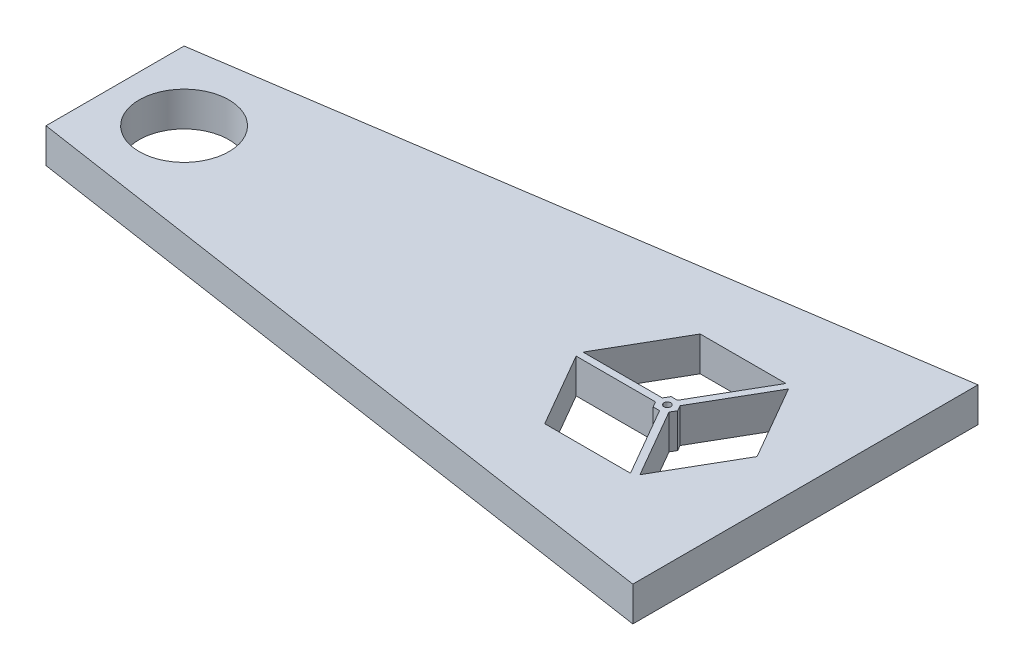
ISO-10303-21;
HEADER;
FILE_DESCRIPTION(('STEP AP214'),'2;1');
FILE_NAME('part.step','',(''),(''),'','','');
FILE_SCHEMA(('AUTOMOTIVE_DESIGN { 1 0 10303 214 1 1 1 1 }'));
ENDSEC;
DATA;
#1=APPLICATION_CONTEXT('core data for automotive mechanical design processes');
#2=APPLICATION_PROTOCOL_DEFINITION('international standard','automotive_design',2000,#1);
#3=PRODUCT_CONTEXT('',#1,'mechanical');
#4=PRODUCT('Part','Part','',(#3));
#5=PRODUCT_RELATED_PRODUCT_CATEGORY('part','',(#4));
#6=PRODUCT_DEFINITION_FORMATION('','',#4);
#7=PRODUCT_DEFINITION_CONTEXT('part definition',#1,'design');
#8=PRODUCT_DEFINITION('design','',#6,#7);
#9=PRODUCT_DEFINITION_SHAPE('','',#8);
#10=(LENGTH_UNIT() NAMED_UNIT(*) SI_UNIT(.MILLI.,.METRE.));
#11=(NAMED_UNIT(*) PLANE_ANGLE_UNIT() SI_UNIT($,.RADIAN.));
#12=(NAMED_UNIT(*) SI_UNIT($,.STERADIAN.) SOLID_ANGLE_UNIT());
#13=UNCERTAINTY_MEASURE_WITH_UNIT(LENGTH_MEASURE(1.E-05),#10,'distance_accuracy_value','');
#14=(GEOMETRIC_REPRESENTATION_CONTEXT(3) GLOBAL_UNCERTAINTY_ASSIGNED_CONTEXT((#13)) GLOBAL_UNIT_ASSIGNED_CONTEXT((#10,
#11,#12)) REPRESENTATION_CONTEXT('',''));
#15=CARTESIAN_POINT('',(0.,0.,0.));
#16=DIRECTION('',(0.,0.,1.));
#17=DIRECTION('',(1.,0.,0.));
#18=AXIS2_PLACEMENT_3D('',#15,#16,#17);
#19=CARTESIAN_POINT('',(23.5,-5.,-11.2583302491977));
#20=DIRECTION('',(-0.866025403784439,0.,-0.5));
#21=DIRECTION('',(-0.5,0.,0.866025403784439));
#22=AXIS2_PLACEMENT_3D('',#19,#20,#21);
#23=PLANE('',#22);
#24=DIRECTION('',(0.,1.,0.));
#25=VECTOR('',#24,1.);
#26=CARTESIAN_POINT('',(17.2886751345948,-5.,-0.499999999999999));
#27=LINE('',#26,#25);
#28=CARTESIAN_POINT('',(17.2886751345948,0.,-0.499999999999999));
#29=VERTEX_POINT('',#28);
#30=CARTESIAN_POINT('',(17.2886751345948,5.,-0.499999999999999));
#31=VERTEX_POINT('',#30);
#32=EDGE_CURVE('E424',#29,#31,#27,.T.);
#33=ORIENTED_EDGE('',*,*,#32,.F.);
#34=DIRECTION('',(0.5,0.,-0.866025403784439));
#35=VECTOR('',#34,1.);
#36=CARTESIAN_POINT('',(12.75,0.,7.36121593216772));
#37=LINE('',#36,#35);
#38=CARTESIAN_POINT('',(23.5,0.,-11.2583302491977));
#39=VERTEX_POINT('',#38);
#40=EDGE_CURVE('E408',#29,#39,#37,.T.);
#41=ORIENTED_EDGE('',*,*,#40,.T.);
#42=DIRECTION('',(0.,1.,0.));
#43=VECTOR('',#42,1.);
#44=CARTESIAN_POINT('',(23.5,-5.,-11.2583302491977));
#45=LINE('',#44,#43);
#46=CARTESIAN_POINT('',(23.5,5.,-11.2583302491977));
#47=VERTEX_POINT('',#46);
#48=EDGE_CURVE('E375',#39,#47,#45,.T.);
#49=ORIENTED_EDGE('',*,*,#48,.T.);
#50=DIRECTION('',(-0.5,0.,0.866025403784439));
#51=VECTOR('',#50,1.);
#52=CARTESIAN_POINT('',(23.5,5.,-11.2583302491977));
#53=LINE('',#52,#51);
#54=EDGE_CURVE('E372',#47,#31,#53,.T.);
#55=ORIENTED_EDGE('',*,*,#54,.T.);
#56=EDGE_LOOP('',(#33,#41,#49,#55));
#57=FACE_BOUND('',#56,.T.);
#58=ADVANCED_FACE('F118',(#57),#23,.F.);
#59=CARTESIAN_POINT('',(36.5,-5.,-11.2583302491977));
#60=DIRECTION('',(0.,0.,-1.));
#61=DIRECTION('',(-1.,0.,0.));
#62=AXIS2_PLACEMENT_3D('',#59,#60,#61);
#63=PLANE('',#62);
#64=DIRECTION('',(0.,-1.,0.));
#65=VECTOR('',#64,1.);
#66=CARTESIAN_POINT('',(35.9226497308103,-5.,-11.2583302491977));
#67=LINE('',#66,#65);
#68=CARTESIAN_POINT('',(35.9226497308104,5.,-11.2583302491977));
#69=VERTEX_POINT('',#68);
#70=CARTESIAN_POINT('',(35.9226497308104,0.,-11.2583302491977));
#71=VERTEX_POINT('',#70);
#72=EDGE_CURVE('E421',#69,#71,#67,.T.);
#73=ORIENTED_EDGE('',*,*,#72,.F.);
#74=DIRECTION('',(-1.,0.,0.));
#75=VECTOR('',#74,1.);
#76=CARTESIAN_POINT('',(36.5,5.,-11.2583302491977));
#77=LINE('',#76,#75);
#78=EDGE_CURVE('E370',#69,#47,#77,.T.);
#79=ORIENTED_EDGE('',*,*,#78,.T.);
#80=ORIENTED_EDGE('',*,*,#48,.F.);
#81=DIRECTION('',(1.,0.,0.));
#82=VECTOR('',#81,1.);
#83=CARTESIAN_POINT('',(0.,0.,-11.2583302491977));
#84=LINE('',#83,#82);
#85=EDGE_CURVE('E405',#39,#71,#84,.T.);
#86=ORIENTED_EDGE('',*,*,#85,.T.);
#87=EDGE_LOOP('',(#73,#79,#80,#86));
#88=FACE_BOUND('',#87,.T.);
#89=ADVANCED_FACE('F453',(#88),#63,.F.);
#90=CARTESIAN_POINT('',(36.5,-5.,11.2583302491977));
#91=DIRECTION('',(0.866025403784439,0.,0.5));
#92=DIRECTION('',(0.5,0.,-0.866025403784439));
#93=AXIS2_PLACEMENT_3D('',#90,#91,#92);
#94=PLANE('',#93);
#95=DIRECTION('',(0.,-1.,0.));
#96=VECTOR('',#95,1.);
#97=CARTESIAN_POINT('',(36.7886751345948,-5.,10.7583302491977));
#98=LINE('',#97,#96);
#99=CARTESIAN_POINT('',(36.7886751345948,5.,10.7583302491977));
#100=VERTEX_POINT('',#99);
#101=CARTESIAN_POINT('',(36.7886751345948,0.,10.7583302491977));
#102=VERTEX_POINT('',#101);
#103=EDGE_CURVE('E415',#100,#102,#98,.T.);
#104=ORIENTED_EDGE('',*,*,#103,.F.);
#105=DIRECTION('',(0.5,0.,-0.866025403784439));
#106=VECTOR('',#105,1.);
#107=CARTESIAN_POINT('',(36.5,5.,11.2583302491977));
#108=LINE('',#107,#106);
#109=CARTESIAN_POINT('',(43.,5.,0.));
#110=VERTEX_POINT('',#109);
#111=EDGE_CURVE('E365',#100,#110,#108,.T.);
#112=ORIENTED_EDGE('',*,*,#111,.T.);
#113=DIRECTION('',(0.,1.,0.));
#114=VECTOR('',#113,1.);
#115=CARTESIAN_POINT('',(43.,-5.,0.));
#116=LINE('',#115,#114);
#117=CARTESIAN_POINT('',(43.,0.,0.));
#118=VERTEX_POINT('',#117);
#119=EDGE_CURVE('E379',#118,#110,#116,.T.);
#120=ORIENTED_EDGE('',*,*,#119,.F.);
#121=DIRECTION('',(-0.5,0.,0.866025403784439));
#122=VECTOR('',#121,1.);
#123=CARTESIAN_POINT('',(32.25,0.,18.6195461813654));
#124=LINE('',#123,#122);
#125=EDGE_CURVE('E400',#118,#102,#124,.T.);
#126=ORIENTED_EDGE('',*,*,#125,.T.);
#127=EDGE_LOOP('',(#104,#112,#120,#126));
#128=FACE_BOUND('',#127,.T.);
#129=ADVANCED_FACE('F478',(#128),#94,.F.);
#130=CARTESIAN_POINT('',(-50.,5.,-25.));
#131=DIRECTION('',(1.,0.,0.));
#132=DIRECTION('',(0.,0.,-1.));
#133=AXIS2_PLACEMENT_3D('',#130,#131,#132);
#134=PLANE('',#133);
#135=DIRECTION('',(0.,0.,1.));
#136=VECTOR('',#135,1.);
#137=CARTESIAN_POINT('',(-50.,5.,-25.));
#138=LINE('',#137,#136);
#139=CARTESIAN_POINT('',(-50.,5.,-10.));
#140=VERTEX_POINT('',#139);
#141=CARTESIAN_POINT('',(-50.,5.,10.));
#142=VERTEX_POINT('',#141);
#143=EDGE_CURVE('E384',#140,#142,#138,.T.);
#144=ORIENTED_EDGE('',*,*,#143,.F.);
#145=DIRECTION('',(0.,1.,0.));
#146=VECTOR('',#145,1.);
#147=CARTESIAN_POINT('',(-50.,0.,-10.));
#148=LINE('',#147,#146);
#149=CARTESIAN_POINT('',(-50.,0.,-10.));
#150=VERTEX_POINT('',#149);
#151=EDGE_CURVE('E349',#150,#140,#148,.T.);
#152=ORIENTED_EDGE('',*,*,#151,.F.);
#153=DIRECTION('',(0.,0.,1.));
#154=VECTOR('',#153,1.);
#155=CARTESIAN_POINT('',(-50.,0.,-25.));
#156=LINE('',#155,#154);
#157=CARTESIAN_POINT('',(-50.,0.,10.));
#158=VERTEX_POINT('',#157);
#159=EDGE_CURVE('E378',#150,#158,#156,.T.);
#160=ORIENTED_EDGE('',*,*,#159,.T.);
#161=DIRECTION('',(0.,1.,0.));
#162=VECTOR('',#161,1.);
#163=CARTESIAN_POINT('',(-50.,0.,10.));
#164=LINE('',#163,#162);
#165=EDGE_CURVE('E355',#158,#142,#164,.T.);
#166=ORIENTED_EDGE('',*,*,#165,.T.);
#167=EDGE_LOOP('',(#144,#152,#160,#166));
#168=FACE_BOUND('',#167,.T.);
#169=ADVANCED_FACE('F120',(#168),#134,.F.);
#170=CARTESIAN_POINT('',(0.,5.,0.));
#171=DIRECTION('',(0.,-1.,0.));
#172=DIRECTION('',(0.,0.,-1.));
#173=AXIS2_PLACEMENT_3D('',#170,#171,#172);
#174=PLANE('',#173);
#175=CARTESIAN_POINT('',(30.,5.,0.));
#176=DIRECTION('',(0.,1.,0.));
#177=DIRECTION('',(0.,0.,1.));
#178=AXIS2_PLACEMENT_3D('',#175,#176,#177);
#179=CIRCLE('',#178,0.499999999999999);
#180=CARTESIAN_POINT('',(30.,5.,0.499999999999999));
#181=VERTEX_POINT('',#180);
#182=EDGE_CURVE('E583',#181,#181,#179,.T.);
#183=ORIENTED_EDGE('',*,*,#182,.F.);
#184=EDGE_LOOP('',(#183));
#185=FACE_BOUND('',#184,.T.);
#186=CARTESIAN_POINT('',(-40.,5.,0.));
#187=DIRECTION('',(0.,1.,0.));
#188=DIRECTION('',(0.,0.,1.));
#189=AXIS2_PLACEMENT_3D('',#186,#187,#188);
#190=CIRCLE('',#189,6.5);
#191=CARTESIAN_POINT('',(-40.,5.,6.5));
#192=VERTEX_POINT('',#191);
#193=EDGE_CURVE('E585',#192,#192,#190,.T.);
#194=ORIENTED_EDGE('',*,*,#193,.F.);
#195=EDGE_LOOP('',(#194));
#196=FACE_BOUND('',#195,.T.);
#197=DIRECTION('',(1.,0.,0.));
#198=VECTOR('',#197,1.);
#199=CARTESIAN_POINT('',(29.25,5.,1.29903810567666));
#200=LINE('',#199,#198);
#201=CARTESIAN_POINT('',(29.25,5.,1.29903810567666));
#202=VERTEX_POINT('',#201);
#203=CARTESIAN_POINT('',(30.1726497308104,5.,1.29903810567666));
#204=VERTEX_POINT('',#203);
#205=EDGE_CURVE('E277',#202,#204,#200,.T.);
#206=ORIENTED_EDGE('',*,*,#205,.T.);
#207=DIRECTION('',(0.499999999999999,0.,0.866025403784439));
#208=VECTOR('',#207,1.);
#209=CARTESIAN_POINT('',(29.5669872981078,5.,0.25));
#210=LINE('',#209,#208);
#211=CARTESIAN_POINT('',(35.9226497308103,5.,11.2583302491977));
#212=VERTEX_POINT('',#211);
#213=EDGE_CURVE('E319',#204,#212,#210,.T.);
#214=ORIENTED_EDGE('',*,*,#213,.T.);
#215=DIRECTION('',(1.,0.,0.));
#216=VECTOR('',#215,1.);
#217=CARTESIAN_POINT('',(23.5,5.,11.2583302491977));
#218=LINE('',#217,#216);
#219=CARTESIAN_POINT('',(23.5,5.,11.2583302491977));
#220=VERTEX_POINT('',#219);
#221=EDGE_CURVE('E362',#220,#212,#218,.T.);
#222=ORIENTED_EDGE('',*,*,#221,.F.);
#223=DIRECTION('',(0.5,0.,0.866025403784438));
#224=VECTOR('',#223,1.);
#225=CARTESIAN_POINT('',(17.,5.,0.));
#226=LINE('',#225,#224);
#227=CARTESIAN_POINT('',(17.2886751345948,5.,0.500000000000001));
#228=VERTEX_POINT('',#227);
#229=EDGE_CURVE('E360',#228,#220,#226,.T.);
#230=ORIENTED_EDGE('',*,*,#229,.F.);
#231=DIRECTION('',(1.,0.,0.));
#232=VECTOR('',#231,1.);
#233=CARTESIAN_POINT('',(17.,5.,0.500000000000001));
#234=LINE('',#233,#232);
#235=CARTESIAN_POINT('',(28.7886751345948,5.,0.5));
#236=VERTEX_POINT('',#235);
#237=EDGE_CURVE('E335',#228,#236,#234,.T.);
#238=ORIENTED_EDGE('',*,*,#237,.T.);
#239=DIRECTION('',(0.500000000000002,0.,0.866025403784437));
#240=VECTOR('',#239,1.);
#241=CARTESIAN_POINT('',(28.5,5.,0.));
#242=LINE('',#241,#240);
#243=EDGE_CURVE('E313',#236,#202,#242,.T.);
#244=ORIENTED_EDGE('',*,*,#243,.T.);
#245=EDGE_LOOP('',(#206,#214,#222,#230,#238,#244));
#246=FACE_BOUND('',#245,.T.);
#247=DIRECTION('',(-0.499999999999998,0.,0.866025403784439));
#248=VECTOR('',#247,1.);
#249=CARTESIAN_POINT('',(29.25,5.,-1.29903810567666));
#250=LINE('',#249,#248);
#251=CARTESIAN_POINT('',(29.25,5.,-1.29903810567666));
#252=VERTEX_POINT('',#251);
#253=CARTESIAN_POINT('',(28.7886751345948,5.,-0.5));
#254=VERTEX_POINT('',#253);
#255=EDGE_CURVE('E310',#252,#254,#250,.T.);
#256=ORIENTED_EDGE('',*,*,#255,.T.);
#257=DIRECTION('',(1.,0.,0.));
#258=VECTOR('',#257,1.);
#259=CARTESIAN_POINT('',(17.,5.,-0.499999999999999));
#260=LINE('',#259,#258);
#261=EDGE_CURVE('E133',#31,#254,#260,.T.);
#262=ORIENTED_EDGE('',*,*,#261,.F.);
#263=ORIENTED_EDGE('',*,*,#54,.F.);
#264=ORIENTED_EDGE('',*,*,#78,.F.);
#265=DIRECTION('',(0.499999999999999,0.,-0.866025403784439));
#266=VECTOR('',#265,1.);
#267=CARTESIAN_POINT('',(29.5669872981078,5.,-0.25));
#268=LINE('',#267,#266);
#269=CARTESIAN_POINT('',(30.1726497308104,5.,-1.29903810567666));
#270=VERTEX_POINT('',#269);
#271=EDGE_CURVE('E324',#270,#69,#268,.T.);
#272=ORIENTED_EDGE('',*,*,#271,.F.);
#273=DIRECTION('',(-1.,0.,0.));
#274=VECTOR('',#273,1.);
#275=CARTESIAN_POINT('',(30.75,5.,-1.29903810567666));
#276=LINE('',#275,#274);
#277=EDGE_CURVE('E308',#270,#252,#276,.T.);
#278=ORIENTED_EDGE('',*,*,#277,.T.);
#279=EDGE_LOOP('',(#256,#262,#263,#264,#272,#278));
#280=FACE_BOUND('',#279,.T.);
#281=DIRECTION('',(0.499999999999999,0.,0.866025403784439));
#282=VECTOR('',#281,1.);
#283=CARTESIAN_POINT('',(30.4330127018922,5.,-0.25));
#284=LINE('',#283,#282);
#285=CARTESIAN_POINT('',(31.0386751345948,5.,0.799038105676666));
#286=VERTEX_POINT('',#285);
#287=EDGE_CURVE('E342',#286,#100,#284,.T.);
#288=ORIENTED_EDGE('',*,*,#287,.F.);
#289=DIRECTION('',(0.499999999999997,0.,-0.86602540378444));
#290=VECTOR('',#289,1.);
#291=CARTESIAN_POINT('',(30.75,5.,1.29903810567666));
#292=LINE('',#291,#290);
#293=CARTESIAN_POINT('',(31.5,5.,0.));
#294=VERTEX_POINT('',#293);
#295=EDGE_CURVE('E304',#286,#294,#292,.T.);
#296=ORIENTED_EDGE('',*,*,#295,.T.);
#297=DIRECTION('',(-0.500000000000004,0.,-0.866025403784436));
#298=VECTOR('',#297,1.);
#299=CARTESIAN_POINT('',(31.5,5.,0.));
#300=LINE('',#299,#298);
#301=CARTESIAN_POINT('',(31.0386751345948,5.,-0.799038105676671));
#302=VERTEX_POINT('',#301);
#303=EDGE_CURVE('E284',#294,#302,#300,.T.);
#304=ORIENTED_EDGE('',*,*,#303,.T.);
#305=DIRECTION('',(0.499999999999999,0.,-0.866025403784439));
#306=VECTOR('',#305,1.);
#307=CARTESIAN_POINT('',(30.4330127018922,5.,0.25));
#308=LINE('',#307,#306);
#309=CARTESIAN_POINT('',(36.7886751345948,5.,-10.7583302491977));
#310=VERTEX_POINT('',#309);
#311=EDGE_CURVE('E327',#302,#310,#308,.T.);
#312=ORIENTED_EDGE('',*,*,#311,.T.);
#313=DIRECTION('',(-0.5,0.,-0.866025403784438));
#314=VECTOR('',#313,1.);
#315=CARTESIAN_POINT('',(43.,5.,0.));
#316=LINE('',#315,#314);
#317=EDGE_CURVE('E367',#110,#310,#316,.T.);
#318=ORIENTED_EDGE('',*,*,#317,.F.);
#319=ORIENTED_EDGE('',*,*,#111,.F.);
#320=EDGE_LOOP('',(#288,#296,#304,#312,#318,#319));
#321=FACE_BOUND('',#320,.T.);
#322=DIRECTION('',(0.,0.,-1.));
#323=VECTOR('',#322,1.);
#324=CARTESIAN_POINT('',(50.,5.,-25.));
#325=LINE('',#324,#323);
#326=CARTESIAN_POINT('',(50.,5.,25.));
#327=VERTEX_POINT('',#326);
#328=CARTESIAN_POINT('',(50.,5.,-25.));
#329=VERTEX_POINT('',#328);
#330=EDGE_CURVE('E386',#327,#329,#325,.T.);
#331=ORIENTED_EDGE('',*,*,#330,.T.);
#332=DIRECTION('',(0.988936352868298,0.,-0.148340452930245));
#333=VECTOR('',#332,1.);
#334=CARTESIAN_POINT('',(-2.56723716381418,5.,-17.1149144254279));
#335=LINE('',#334,#333);
#336=EDGE_CURVE('E326',#140,#329,#335,.T.);
#337=ORIENTED_EDGE('',*,*,#336,.F.);
#338=ORIENTED_EDGE('',*,*,#143,.T.);
#339=DIRECTION('',(0.988936352868298,0.,0.148340452930245));
#340=VECTOR('',#339,1.);
#341=CARTESIAN_POINT('',(-2.56723716381418,5.,17.1149144254279));
#342=LINE('',#341,#340);
#343=EDGE_CURVE('E352',#142,#327,#342,.T.);
#344=ORIENTED_EDGE('',*,*,#343,.T.);
#345=EDGE_LOOP('',(#331,#337,#338,#344));
#346=FACE_BOUND('',#345,.T.);
#347=ADVANCED_FACE('F447',(#185,#196,#246,#280,#321,#346),#174,.F.);
#348=CARTESIAN_POINT('',(0.,0.,0.));
#349=DIRECTION('',(0.,-1.,0.));
#350=DIRECTION('',(0.,0.,-1.));
#351=AXIS2_PLACEMENT_3D('',#348,#349,#350);
#352=PLANE('',#351);
#353=CARTESIAN_POINT('',(30.,0.,0.));
#354=DIRECTION('',(0.,1.,0.));
#355=DIRECTION('',(0.,0.,1.));
#356=AXIS2_PLACEMENT_3D('',#353,#354,#355);
#357=CIRCLE('',#356,0.499999999999999);
#358=CARTESIAN_POINT('',(30.,0.,0.499999999999999));
#359=VERTEX_POINT('',#358);
#360=EDGE_CURVE('E580',#359,#359,#357,.T.);
#361=ORIENTED_EDGE('',*,*,#360,.T.);
#362=EDGE_LOOP('',(#361));
#363=FACE_BOUND('',#362,.T.);
#364=CARTESIAN_POINT('',(-40.,0.,0.));
#365=DIRECTION('',(0.,1.,0.));
#366=DIRECTION('',(0.,0.,1.));
#367=AXIS2_PLACEMENT_3D('',#364,#365,#366);
#368=CIRCLE('',#367,6.5);
#369=CARTESIAN_POINT('',(-40.,0.,6.5));
#370=VERTEX_POINT('',#369);
#371=EDGE_CURVE('E306',#370,#370,#368,.T.);
#372=ORIENTED_EDGE('',*,*,#371,.T.);
#373=EDGE_LOOP('',(#372));
#374=FACE_BOUND('',#373,.T.);
#375=DIRECTION('',(0.499999999999999,0.,0.866025403784439));
#376=VECTOR('',#375,1.);
#377=CARTESIAN_POINT('',(29.5669872981078,0.,0.25));
#378=LINE('',#377,#376);
#379=CARTESIAN_POINT('',(30.1726497308104,0.,1.29903810567666));
#380=VERTEX_POINT('',#379);
#381=CARTESIAN_POINT('',(35.9226497308103,0.,11.2583302491977));
#382=VERTEX_POINT('',#381);
#383=EDGE_CURVE('E340',#380,#382,#378,.T.);
#384=ORIENTED_EDGE('',*,*,#383,.F.);
#385=DIRECTION('',(1.,0.,0.));
#386=VECTOR('',#385,1.);
#387=CARTESIAN_POINT('',(29.25,0.,1.29903810567666));
#388=LINE('',#387,#386);
#389=CARTESIAN_POINT('',(29.25,0.,1.29903810567666));
#390=VERTEX_POINT('',#389);
#391=EDGE_CURVE('E286',#390,#380,#388,.T.);
#392=ORIENTED_EDGE('',*,*,#391,.F.);
#393=DIRECTION('',(0.500000000000002,0.,0.866025403784437));
#394=VECTOR('',#393,1.);
#395=CARTESIAN_POINT('',(28.5,0.,0.));
#396=LINE('',#395,#394);
#397=CARTESIAN_POINT('',(28.7886751345948,0.,0.5));
#398=VERTEX_POINT('',#397);
#399=EDGE_CURVE('E301',#398,#390,#396,.T.);
#400=ORIENTED_EDGE('',*,*,#399,.F.);
#401=DIRECTION('',(1.,0.,0.));
#402=VECTOR('',#401,1.);
#403=CARTESIAN_POINT('',(17.,0.,0.500000000000001));
#404=LINE('',#403,#402);
#405=CARTESIAN_POINT('',(17.2886751345948,0.,0.500000000000004));
#406=VERTEX_POINT('',#405);
#407=EDGE_CURVE('E331',#406,#398,#404,.T.);
#408=ORIENTED_EDGE('',*,*,#407,.F.);
#409=DIRECTION('',(-0.5,0.,-0.866025403784439));
#410=VECTOR('',#409,1.);
#411=CARTESIAN_POINT('',(12.75,0.,-7.36121593216773));
#412=LINE('',#411,#410);
#413=CARTESIAN_POINT('',(23.5,0.,11.2583302491977));
#414=VERTEX_POINT('',#413);
#415=EDGE_CURVE('E410',#414,#406,#412,.T.);
#416=ORIENTED_EDGE('',*,*,#415,.F.);
#417=DIRECTION('',(-1.,0.,0.));
#418=VECTOR('',#417,1.);
#419=CARTESIAN_POINT('',(0.,0.,11.2583302491977));
#420=LINE('',#419,#418);
#421=EDGE_CURVE('E398',#382,#414,#420,.T.);
#422=ORIENTED_EDGE('',*,*,#421,.F.);
#423=EDGE_LOOP('',(#384,#392,#400,#408,#416,#422));
#424=FACE_BOUND('',#423,.T.);
#425=DIRECTION('',(1.,0.,0.));
#426=VECTOR('',#425,1.);
#427=CARTESIAN_POINT('',(17.,0.,-0.499999999999999));
#428=LINE('',#427,#426);
#429=CARTESIAN_POINT('',(28.7886751345948,0.,-0.5));
#430=VERTEX_POINT('',#429);
#431=EDGE_CURVE('E329',#29,#430,#428,.T.);
#432=ORIENTED_EDGE('',*,*,#431,.T.);
#433=DIRECTION('',(-0.499999999999998,0.,0.866025403784439));
#434=VECTOR('',#433,1.);
#435=CARTESIAN_POINT('',(29.25,0.,-1.29903810567666));
#436=LINE('',#435,#434);
#437=CARTESIAN_POINT('',(29.25,0.,-1.29903810567666));
#438=VERTEX_POINT('',#437);
#439=EDGE_CURVE('E295',#438,#430,#436,.T.);
#440=ORIENTED_EDGE('',*,*,#439,.F.);
#441=DIRECTION('',(-1.,0.,0.));
#442=VECTOR('',#441,1.);
#443=CARTESIAN_POINT('',(30.75,0.,-1.29903810567666));
#444=LINE('',#443,#442);
#445=CARTESIAN_POINT('',(30.1726497308104,0.,-1.29903810567666));
#446=VERTEX_POINT('',#445);
#447=EDGE_CURVE('E293',#446,#438,#444,.T.);
#448=ORIENTED_EDGE('',*,*,#447,.F.);
#449=DIRECTION('',(0.499999999999999,0.,-0.866025403784439));
#450=VECTOR('',#449,1.);
#451=CARTESIAN_POINT('',(29.5669872981078,0.,-0.25));
#452=LINE('',#451,#450);
#453=EDGE_CURVE('E323',#446,#71,#452,.T.);
#454=ORIENTED_EDGE('',*,*,#453,.T.);
#455=ORIENTED_EDGE('',*,*,#85,.F.);
#456=ORIENTED_EDGE('',*,*,#40,.F.);
#457=EDGE_LOOP('',(#432,#440,#448,#454,#455,#456));
#458=FACE_BOUND('',#457,.T.);
#459=DIRECTION('',(0.499999999999997,0.,-0.86602540378444));
#460=VECTOR('',#459,1.);
#461=CARTESIAN_POINT('',(30.75,0.,1.29903810567666));
#462=LINE('',#461,#460);
#463=CARTESIAN_POINT('',(31.0386751345948,0.,0.799038105676666));
#464=VERTEX_POINT('',#463);
#465=CARTESIAN_POINT('',(31.5,0.,0.));
#466=VERTEX_POINT('',#465);
#467=EDGE_CURVE('E266',#464,#466,#462,.T.);
#468=ORIENTED_EDGE('',*,*,#467,.F.);
#469=DIRECTION('',(0.499999999999999,0.,0.866025403784439));
#470=VECTOR('',#469,1.);
#471=CARTESIAN_POINT('',(30.4330127018922,0.,-0.25));
#472=LINE('',#471,#470);
#473=EDGE_CURVE('E338',#464,#102,#472,.T.);
#474=ORIENTED_EDGE('',*,*,#473,.T.);
#475=ORIENTED_EDGE('',*,*,#125,.F.);
#476=DIRECTION('',(0.5,0.,0.866025403784439));
#477=VECTOR('',#476,1.);
#478=CARTESIAN_POINT('',(32.25,0.,-18.6195461813654));
#479=LINE('',#478,#477);
#480=CARTESIAN_POINT('',(36.7886751345948,0.,-10.7583302491977));
#481=VERTEX_POINT('',#480);
#482=EDGE_CURVE('E403',#481,#118,#479,.T.);
#483=ORIENTED_EDGE('',*,*,#482,.F.);
#484=DIRECTION('',(0.499999999999999,0.,-0.866025403784439));
#485=VECTOR('',#484,1.);
#486=CARTESIAN_POINT('',(30.4330127018922,0.,0.25));
#487=LINE('',#486,#485);
#488=CARTESIAN_POINT('',(31.0386751345948,0.,-0.799038105676671));
#489=VERTEX_POINT('',#488);
#490=EDGE_CURVE('E292',#489,#481,#487,.T.);
#491=ORIENTED_EDGE('',*,*,#490,.F.);
#492=DIRECTION('',(-0.500000000000004,0.,-0.866025403784436));
#493=VECTOR('',#492,1.);
#494=CARTESIAN_POINT('',(31.5,0.,0.));
#495=LINE('',#494,#493);
#496=EDGE_CURVE('E276',#466,#489,#495,.T.);
#497=ORIENTED_EDGE('',*,*,#496,.F.);
#498=EDGE_LOOP('',(#468,#474,#475,#483,#491,#497));
#499=FACE_BOUND('',#498,.T.);
#500=DIRECTION('',(0.988936352868298,0.,-0.148340452930245));
#501=VECTOR('',#500,1.);
#502=CARTESIAN_POINT('',(-2.56723716381418,0.,-17.1149144254279));
#503=LINE('',#502,#501);
#504=CARTESIAN_POINT('',(50.,0.,-25.));
#505=VERTEX_POINT('',#504);
#506=EDGE_CURVE('E346',#150,#505,#503,.T.);
#507=ORIENTED_EDGE('',*,*,#506,.T.);
#508=DIRECTION('',(0.,0.,-1.));
#509=VECTOR('',#508,1.);
#510=CARTESIAN_POINT('',(50.,0.,-25.));
#511=LINE('',#510,#509);
#512=CARTESIAN_POINT('',(50.,0.,25.));
#513=VERTEX_POINT('',#512);
#514=EDGE_CURVE('E387',#513,#505,#511,.T.);
#515=ORIENTED_EDGE('',*,*,#514,.F.);
#516=DIRECTION('',(0.988936352868298,0.,0.148340452930245));
#517=VECTOR('',#516,1.);
#518=CARTESIAN_POINT('',(-2.56723716381418,0.,17.1149144254279));
#519=LINE('',#518,#517);
#520=EDGE_CURVE('E353',#158,#513,#519,.T.);
#521=ORIENTED_EDGE('',*,*,#520,.F.);
#522=ORIENTED_EDGE('',*,*,#159,.F.);
#523=EDGE_LOOP('',(#507,#515,#521,#522));
#524=FACE_BOUND('',#523,.T.);
#525=ADVANCED_FACE('F289',(#363,#374,#424,#458,#499,#524),#352,.T.);
#526=CARTESIAN_POINT('',(50.,5.,-25.));
#527=DIRECTION('',(-1.,0.,0.));
#528=DIRECTION('',(0.,0.,1.));
#529=AXIS2_PLACEMENT_3D('',#526,#527,#528);
#530=PLANE('',#529);
#531=ORIENTED_EDGE('',*,*,#514,.T.);
#532=DIRECTION('',(0.,-1.,0.));
#533=VECTOR('',#532,1.);
#534=CARTESIAN_POINT('',(50.,5.,-25.));
#535=LINE('',#534,#533);
#536=EDGE_CURVE('E390',#329,#505,#535,.T.);
#537=ORIENTED_EDGE('',*,*,#536,.F.);
#538=ORIENTED_EDGE('',*,*,#330,.F.);
#539=DIRECTION('',(0.,-1.,0.));
#540=VECTOR('',#539,1.);
#541=CARTESIAN_POINT('',(50.,5.,25.));
#542=LINE('',#541,#540);
#543=EDGE_CURVE('E395',#327,#513,#542,.T.);
#544=ORIENTED_EDGE('',*,*,#543,.T.);
#545=EDGE_LOOP('',(#531,#537,#538,#544));
#546=FACE_BOUND('',#545,.T.);
#547=ADVANCED_FACE('F498',(#546),#530,.F.);
#548=CARTESIAN_POINT('',(17.,-5.,0.));
#549=DIRECTION('',(-0.866025403784438,0.,0.5));
#550=DIRECTION('',(0.5,0.,0.866025403784439));
#551=AXIS2_PLACEMENT_3D('',#548,#549,#550);
#552=PLANE('',#551);
#553=ORIENTED_EDGE('',*,*,#415,.T.);
#554=DIRECTION('',(0.,1.,0.));
#555=VECTOR('',#554,1.);
#556=CARTESIAN_POINT('',(17.2886751345948,-5.,0.500000000000001));
#557=LINE('',#556,#555);
#558=EDGE_CURVE('E426',#406,#228,#557,.T.);
#559=ORIENTED_EDGE('',*,*,#558,.T.);
#560=ORIENTED_EDGE('',*,*,#229,.T.);
#561=DIRECTION('',(0.,1.,0.));
#562=VECTOR('',#561,1.);
#563=CARTESIAN_POINT('',(23.5,-5.,11.2583302491977));
#564=LINE('',#563,#562);
#565=EDGE_CURVE('E374',#414,#220,#564,.T.);
#566=ORIENTED_EDGE('',*,*,#565,.F.);
#567=EDGE_LOOP('',(#553,#559,#560,#566));
#568=FACE_BOUND('',#567,.T.);
#569=ADVANCED_FACE('F488',(#568),#552,.F.);
#570=CARTESIAN_POINT('',(43.,-5.,0.));
#571=DIRECTION('',(0.866025403784438,0.,-0.5));
#572=DIRECTION('',(-0.5,0.,-0.866025403784439));
#573=AXIS2_PLACEMENT_3D('',#570,#571,#572);
#574=PLANE('',#573);
#575=ORIENTED_EDGE('',*,*,#317,.T.);
#576=DIRECTION('',(0.,-1.,0.));
#577=VECTOR('',#576,1.);
#578=CARTESIAN_POINT('',(36.7886751345948,-5.,-10.7583302491977));
#579=LINE('',#578,#577);
#580=EDGE_CURVE('E418',#310,#481,#579,.T.);
#581=ORIENTED_EDGE('',*,*,#580,.T.);
#582=ORIENTED_EDGE('',*,*,#482,.T.);
#583=ORIENTED_EDGE('',*,*,#119,.T.);
#584=EDGE_LOOP('',(#575,#581,#582,#583));
#585=FACE_BOUND('',#584,.T.);
#586=ADVANCED_FACE('F484',(#585),#574,.F.);
#587=CARTESIAN_POINT('',(23.5,-5.,11.2583302491977));
#588=DIRECTION('',(0.,0.,1.));
#589=DIRECTION('',(1.,0.,0.));
#590=AXIS2_PLACEMENT_3D('',#587,#588,#589);
#591=PLANE('',#590);
#592=ORIENTED_EDGE('',*,*,#221,.T.);
#593=DIRECTION('',(0.,-1.,0.));
#594=VECTOR('',#593,1.);
#595=CARTESIAN_POINT('',(35.9226497308103,-5.,11.2583302491977));
#596=LINE('',#595,#594);
#597=EDGE_CURVE('E412',#212,#382,#596,.T.);
#598=ORIENTED_EDGE('',*,*,#597,.T.);
#599=ORIENTED_EDGE('',*,*,#421,.T.);
#600=ORIENTED_EDGE('',*,*,#565,.T.);
#601=EDGE_LOOP('',(#592,#598,#599,#600));
#602=FACE_BOUND('',#601,.T.);
#603=ADVANCED_FACE('F487',(#602),#591,.F.);
#604=CARTESIAN_POINT('',(-2.56723716381418,0.,17.1149144254279));
#605=DIRECTION('',(-0.148340452930245,0.,0.988936352868298));
#606=DIRECTION('',(0.988936352868298,0.,0.148340452930245));
#607=AXIS2_PLACEMENT_3D('',#604,#605,#606);
#608=PLANE('',#607);
#609=ORIENTED_EDGE('',*,*,#343,.F.);
#610=ORIENTED_EDGE('',*,*,#165,.F.);
#611=ORIENTED_EDGE('',*,*,#520,.T.);
#612=ORIENTED_EDGE('',*,*,#543,.F.);
#613=EDGE_LOOP('',(#609,#610,#611,#612));
#614=FACE_BOUND('',#613,.T.);
#615=ADVANCED_FACE('F481',(#614),#608,.T.);
#616=CARTESIAN_POINT('',(-2.56723716381418,0.,-17.1149144254279));
#617=DIRECTION('',(0.148340452930245,0.,0.988936352868298));
#618=DIRECTION('',(0.988936352868298,0.,-0.148340452930245));
#619=AXIS2_PLACEMENT_3D('',#616,#617,#618);
#620=PLANE('',#619);
#621=ORIENTED_EDGE('',*,*,#336,.T.);
#622=ORIENTED_EDGE('',*,*,#536,.T.);
#623=ORIENTED_EDGE('',*,*,#506,.F.);
#624=ORIENTED_EDGE('',*,*,#151,.T.);
#625=EDGE_LOOP('',(#621,#622,#623,#624));
#626=FACE_BOUND('',#625,.T.);
#627=ADVANCED_FACE('F469',(#626),#620,.F.);
#628=CARTESIAN_POINT('',(17.,0.,0.500000000000001));
#629=DIRECTION('',(0.,0.,1.));
#630=DIRECTION('',(1.,0.,0.));
#631=AXIS2_PLACEMENT_3D('',#628,#629,#630);
#632=PLANE('',#631);
#633=DIRECTION('',(0.,-1.,0.));
#634=VECTOR('',#633,1.);
#635=CARTESIAN_POINT('',(28.7886751345948,0.,0.5));
#636=LINE('',#635,#634);
#637=EDGE_CURVE('E14',#236,#398,#636,.T.);
#638=ORIENTED_EDGE('',*,*,#637,.F.);
#639=ORIENTED_EDGE('',*,*,#237,.F.);
#640=ORIENTED_EDGE('',*,*,#558,.F.);
#641=ORIENTED_EDGE('',*,*,#407,.T.);
#642=EDGE_LOOP('',(#638,#639,#640,#641));
#643=FACE_BOUND('',#642,.T.);
#644=ADVANCED_FACE('F461',(#643),#632,.T.);
#645=CARTESIAN_POINT('',(17.,0.,-0.499999999999999));
#646=DIRECTION('',(0.,0.,1.));
#647=DIRECTION('',(1.,0.,0.));
#648=AXIS2_PLACEMENT_3D('',#645,#646,#647);
#649=PLANE('',#648);
#650=ORIENTED_EDGE('',*,*,#261,.T.);
#651=DIRECTION('',(0.,-1.,0.));
#652=VECTOR('',#651,1.);
#653=CARTESIAN_POINT('',(28.7886751345948,0.,-0.5));
#654=LINE('',#653,#652);
#655=EDGE_CURVE('E126',#254,#430,#654,.T.);
#656=ORIENTED_EDGE('',*,*,#655,.T.);
#657=ORIENTED_EDGE('',*,*,#431,.F.);
#658=ORIENTED_EDGE('',*,*,#32,.T.);
#659=EDGE_LOOP('',(#650,#656,#657,#658));
#660=FACE_BOUND('',#659,.T.);
#661=ADVANCED_FACE('F459',(#660),#649,.F.);
#662=CARTESIAN_POINT('',(29.5669872981078,0.,-0.25));
#663=DIRECTION('',(0.866025403784439,0.,0.499999999999999));
#664=DIRECTION('',(0.499999999999999,0.,-0.866025403784439));
#665=AXIS2_PLACEMENT_3D('',#662,#663,#664);
#666=PLANE('',#665);
#667=ORIENTED_EDGE('',*,*,#453,.F.);
#668=DIRECTION('',(0.,1.,0.));
#669=VECTOR('',#668,1.);
#670=CARTESIAN_POINT('',(30.1726497308104,0.,-1.29903810567666));
#671=LINE('',#670,#669);
#672=EDGE_CURVE('E434',#446,#270,#671,.T.);
#673=ORIENTED_EDGE('',*,*,#672,.T.);
#674=ORIENTED_EDGE('',*,*,#271,.T.);
#675=ORIENTED_EDGE('',*,*,#72,.T.);
#676=EDGE_LOOP('',(#667,#673,#674,#675));
#677=FACE_BOUND('',#676,.T.);
#678=ADVANCED_FACE('F439',(#677),#666,.F.);
#679=CARTESIAN_POINT('',(30.4330127018922,0.,0.25));
#680=DIRECTION('',(0.866025403784439,0.,0.499999999999999));
#681=DIRECTION('',(0.499999999999999,0.,-0.866025403784439));
#682=AXIS2_PLACEMENT_3D('',#679,#680,#681);
#683=PLANE('',#682);
#684=DIRECTION('',(0.,1.,0.));
#685=VECTOR('',#684,1.);
#686=CARTESIAN_POINT('',(31.0386751345948,0.,-0.799038105676669));
#687=LINE('',#686,#685);
#688=EDGE_CURVE('E432',#489,#302,#687,.T.);
#689=ORIENTED_EDGE('',*,*,#688,.F.);
#690=ORIENTED_EDGE('',*,*,#490,.T.);
#691=ORIENTED_EDGE('',*,*,#580,.F.);
#692=ORIENTED_EDGE('',*,*,#311,.F.);
#693=EDGE_LOOP('',(#689,#690,#691,#692));
#694=FACE_BOUND('',#693,.T.);
#695=ADVANCED_FACE('F467',(#694),#683,.T.);
#696=CARTESIAN_POINT('',(30.4330127018922,0.,-0.25));
#697=DIRECTION('',(-0.866025403784439,0.,0.499999999999999));
#698=DIRECTION('',(0.499999999999999,0.,0.866025403784439));
#699=AXIS2_PLACEMENT_3D('',#696,#697,#698);
#700=PLANE('',#699);
#701=ORIENTED_EDGE('',*,*,#473,.F.);
#702=DIRECTION('',(0.,1.,0.));
#703=VECTOR('',#702,1.);
#704=CARTESIAN_POINT('',(31.0386751345948,0.,0.799038105676666));
#705=LINE('',#704,#703);
#706=EDGE_CURVE('E273',#464,#286,#705,.T.);
#707=ORIENTED_EDGE('',*,*,#706,.T.);
#708=ORIENTED_EDGE('',*,*,#287,.T.);
#709=ORIENTED_EDGE('',*,*,#103,.T.);
#710=EDGE_LOOP('',(#701,#707,#708,#709));
#711=FACE_BOUND('',#710,.T.);
#712=ADVANCED_FACE('F534',(#711),#700,.F.);
#713=CARTESIAN_POINT('',(29.5669872981078,0.,0.25));
#714=DIRECTION('',(-0.866025403784439,0.,0.499999999999999));
#715=DIRECTION('',(0.499999999999999,0.,0.866025403784439));
#716=AXIS2_PLACEMENT_3D('',#713,#714,#715);
#717=PLANE('',#716);
#718=DIRECTION('',(0.,1.,0.));
#719=VECTOR('',#718,1.);
#720=CARTESIAN_POINT('',(30.1726497308104,0.,1.29903810567666));
#721=LINE('',#720,#719);
#722=EDGE_CURVE('E428',#380,#204,#721,.T.);
#723=ORIENTED_EDGE('',*,*,#722,.F.);
#724=ORIENTED_EDGE('',*,*,#383,.T.);
#725=ORIENTED_EDGE('',*,*,#597,.F.);
#726=ORIENTED_EDGE('',*,*,#213,.F.);
#727=EDGE_LOOP('',(#723,#724,#725,#726));
#728=FACE_BOUND('',#727,.T.);
#729=ADVANCED_FACE('F530',(#728),#717,.T.);
#730=CARTESIAN_POINT('',(29.25,0.,1.29903810567666));
#731=DIRECTION('',(0.,0.,1.));
#732=DIRECTION('',(1.,0.,0.));
#733=AXIS2_PLACEMENT_3D('',#730,#731,#732);
#734=PLANE('',#733);
#735=ORIENTED_EDGE('',*,*,#391,.T.);
#736=ORIENTED_EDGE('',*,*,#722,.T.);
#737=ORIENTED_EDGE('',*,*,#205,.F.);
#738=DIRECTION('',(0.,1.,0.));
#739=VECTOR('',#738,1.);
#740=CARTESIAN_POINT('',(29.25,0.,1.29903810567666));
#741=LINE('',#740,#739);
#742=EDGE_CURVE('E316',#390,#202,#741,.T.);
#743=ORIENTED_EDGE('',*,*,#742,.F.);
#744=EDGE_LOOP('',(#735,#736,#737,#743));
#745=FACE_BOUND('',#744,.T.);
#746=ADVANCED_FACE('F533',(#745),#734,.T.);
#747=CARTESIAN_POINT('',(28.5,0.,0.));
#748=DIRECTION('',(-0.866025403784437,0.,0.500000000000002));
#749=DIRECTION('',(0.500000000000002,0.,0.866025403784437));
#750=AXIS2_PLACEMENT_3D('',#747,#748,#749);
#751=PLANE('',#750);
#752=ORIENTED_EDGE('',*,*,#243,.F.);
#753=ORIENTED_EDGE('',*,*,#637,.T.);
#754=ORIENTED_EDGE('',*,*,#399,.T.);
#755=ORIENTED_EDGE('',*,*,#742,.T.);
#756=EDGE_LOOP('',(#752,#753,#754,#755));
#757=FACE_BOUND('',#756,.T.);
#758=ADVANCED_FACE('F553',(#757),#751,.T.);
#759=CARTESIAN_POINT('',(30.75,0.,1.29903810567666));
#760=DIRECTION('',(0.86602540378444,0.,0.499999999999997));
#761=DIRECTION('',(0.499999999999997,0.,-0.86602540378444));
#762=AXIS2_PLACEMENT_3D('',#759,#760,#761);
#763=PLANE('',#762);
#764=ORIENTED_EDGE('',*,*,#706,.F.);
#765=ORIENTED_EDGE('',*,*,#467,.T.);
#766=DIRECTION('',(0.,1.,0.));
#767=VECTOR('',#766,1.);
#768=CARTESIAN_POINT('',(31.5,0.,0.));
#769=LINE('',#768,#767);
#770=EDGE_CURVE('E270',#466,#294,#769,.T.);
#771=ORIENTED_EDGE('',*,*,#770,.T.);
#772=ORIENTED_EDGE('',*,*,#295,.F.);
#773=EDGE_LOOP('',(#764,#765,#771,#772));
#774=FACE_BOUND('',#773,.T.);
#775=ADVANCED_FACE('F268',(#774),#763,.T.);
#776=CARTESIAN_POINT('',(31.5,0.,0.));
#777=DIRECTION('',(0.866025403784437,0.,-0.500000000000004));
#778=DIRECTION('',(-0.500000000000004,0.,-0.866025403784437));
#779=AXIS2_PLACEMENT_3D('',#776,#777,#778);
#780=PLANE('',#779);
#781=ORIENTED_EDGE('',*,*,#496,.T.);
#782=ORIENTED_EDGE('',*,*,#688,.T.);
#783=ORIENTED_EDGE('',*,*,#303,.F.);
#784=ORIENTED_EDGE('',*,*,#770,.F.);
#785=EDGE_LOOP('',(#781,#782,#783,#784));
#786=FACE_BOUND('',#785,.T.);
#787=ADVANCED_FACE('F281',(#786),#780,.T.);
#788=CARTESIAN_POINT('',(29.25,0.,-1.29903810567666));
#789=DIRECTION('',(-0.866025403784439,0.,-0.499999999999998));
#790=DIRECTION('',(-0.499999999999999,0.,0.86602540378444));
#791=AXIS2_PLACEMENT_3D('',#788,#789,#790);
#792=PLANE('',#791);
#793=ORIENTED_EDGE('',*,*,#655,.F.);
#794=ORIENTED_EDGE('',*,*,#255,.F.);
#795=DIRECTION('',(0.,1.,0.));
#796=VECTOR('',#795,1.);
#797=CARTESIAN_POINT('',(29.25,0.,-1.29903810567666));
#798=LINE('',#797,#796);
#799=EDGE_CURVE('E285',#438,#252,#798,.T.);
#800=ORIENTED_EDGE('',*,*,#799,.F.);
#801=ORIENTED_EDGE('',*,*,#439,.T.);
#802=EDGE_LOOP('',(#793,#794,#800,#801));
#803=FACE_BOUND('',#802,.T.);
#804=ADVANCED_FACE('F556',(#803),#792,.T.);
#805=CARTESIAN_POINT('',(30.75,0.,-1.29903810567666));
#806=DIRECTION('',(0.,0.,-1.));
#807=DIRECTION('',(-1.,0.,0.));
#808=AXIS2_PLACEMENT_3D('',#805,#806,#807);
#809=PLANE('',#808);
#810=ORIENTED_EDGE('',*,*,#672,.F.);
#811=ORIENTED_EDGE('',*,*,#447,.T.);
#812=ORIENTED_EDGE('',*,*,#799,.T.);
#813=ORIENTED_EDGE('',*,*,#277,.F.);
#814=EDGE_LOOP('',(#810,#811,#812,#813));
#815=FACE_BOUND('',#814,.T.);
#816=ADVANCED_FACE('F443',(#815),#809,.T.);
#817=CARTESIAN_POINT('',(-40.,0.,0.));
#818=DIRECTION('',(0.,1.,0.));
#819=DIRECTION('',(0.,0.,1.));
#820=AXIS2_PLACEMENT_3D('',#817,#818,#819);
#821=CYLINDRICAL_SURFACE('',#820,6.5);
#822=ORIENTED_EDGE('',*,*,#371,.F.);
#823=EDGE_LOOP('',(#822));
#824=FACE_BOUND('',#823,.T.);
#825=ORIENTED_EDGE('',*,*,#193,.T.);
#826=EDGE_LOOP('',(#825));
#827=FACE_BOUND('',#826,.T.);
#828=ADVANCED_FACE('F559',(#824,#827),#821,.F.);
#829=CARTESIAN_POINT('',(30.,0.,0.));
#830=DIRECTION('',(0.,1.,0.));
#831=DIRECTION('',(0.,0.,1.));
#832=AXIS2_PLACEMENT_3D('',#829,#830,#831);
#833=CYLINDRICAL_SURFACE('',#832,0.499999999999999);
#834=ORIENTED_EDGE('',*,*,#360,.F.);
#835=EDGE_LOOP('',(#834));
#836=FACE_BOUND('',#835,.T.);
#837=ORIENTED_EDGE('',*,*,#182,.T.);
#838=EDGE_LOOP('',(#837));
#839=FACE_BOUND('',#838,.T.);
#840=ADVANCED_FACE('F571',(#836,#839),#833,.F.);
#841=CLOSED_SHELL('',(#58,#89,#129,#169,#347,#525,#547,#569,#586,#603,#615,#627,#644,#661,#678,
#695,#712,#729,#746,#758,#775,#787,#804,#816,#828,#840));
#842=MANIFOLD_SOLID_BREP('B2',#841);
#843=ADVANCED_BREP_SHAPE_REPRESENTATION('',(#18,#842),#14);
#844=SHAPE_DEFINITION_REPRESENTATION(#9,#843);
ENDSEC;
END-ISO-10303-21;
